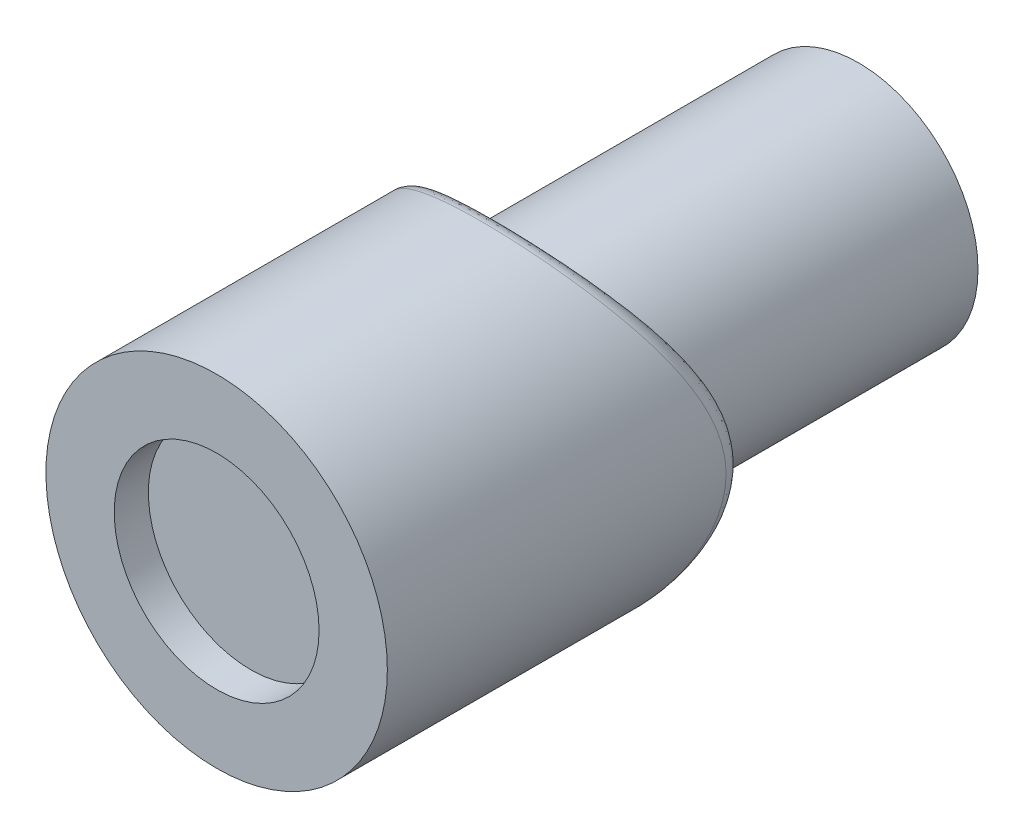
ISO-10303-21;
HEADER;
FILE_DESCRIPTION(('STEP AP214'),'2;1');
FILE_NAME('part.step','',(''),(''),'','','');
FILE_SCHEMA(('AUTOMOTIVE_DESIGN { 1 0 10303 214 1 1 1 1 }'));
ENDSEC;
DATA;
#1=APPLICATION_CONTEXT('core data for automotive mechanical design processes');
#2=APPLICATION_PROTOCOL_DEFINITION('international standard','automotive_design',2000,#1);
#3=PRODUCT_CONTEXT('',#1,'mechanical');
#4=PRODUCT('Part','Part','',(#3));
#5=PRODUCT_RELATED_PRODUCT_CATEGORY('part','',(#4));
#6=PRODUCT_DEFINITION_FORMATION('','',#4);
#7=PRODUCT_DEFINITION_CONTEXT('part definition',#1,'design');
#8=PRODUCT_DEFINITION('design','',#6,#7);
#9=PRODUCT_DEFINITION_SHAPE('','',#8);
#10=(LENGTH_UNIT() NAMED_UNIT(*) SI_UNIT(.MILLI.,.METRE.));
#11=(NAMED_UNIT(*) PLANE_ANGLE_UNIT() SI_UNIT($,.RADIAN.));
#12=(NAMED_UNIT(*) SI_UNIT($,.STERADIAN.) SOLID_ANGLE_UNIT());
#13=UNCERTAINTY_MEASURE_WITH_UNIT(LENGTH_MEASURE(1.E-05),#10,'distance_accuracy_value','');
#14=(GEOMETRIC_REPRESENTATION_CONTEXT(3) GLOBAL_UNCERTAINTY_ASSIGNED_CONTEXT((#13)) GLOBAL_UNIT_ASSIGNED_CONTEXT((#10,
#11,#12)) REPRESENTATION_CONTEXT('',''));
#15=CARTESIAN_POINT('',(0.,0.,0.));
#16=DIRECTION('',(0.,0.,1.));
#17=DIRECTION('',(1.,0.,0.));
#18=AXIS2_PLACEMENT_3D('',#15,#16,#17);
#19=CARTESIAN_POINT('',(0.,0.,-18.7999999999999));
#20=DIRECTION('',(0.,0.,1.));
#21=DIRECTION('',(-1.,0.,0.));
#22=AXIS2_PLACEMENT_3D('',#19,#20,#21);
#23=CYLINDRICAL_SURFACE('',#22,5.);
#24=CARTESIAN_POINT('',(5.,0.,-9.92054473418087));
#25=CARTESIAN_POINT('',(5.,-0.394893347093318,-9.92054473418087));
#26=CARTESIAN_POINT('',(4.90439112526284,-1.18177929090862,-9.80820862824213));
#27=CARTESIAN_POINT('',(4.38934415505402,-2.57361505187322,-9.28963254071878));
#28=CARTESIAN_POINT('',(3.28606552163645,-3.97436445188582,-8.46074115903324));
#29=CARTESIAN_POINT('',(1.58120612322744,-4.85752802696362,-7.85125270224386));
#30=CARTESIAN_POINT('',(-3.95046673941243E-05,-5.04753097211932,-7.71617126727592));
#31=CARTESIAN_POINT('',(-1.58164656688379,-4.85811099232312,-7.85146403600861));
#32=CARTESIAN_POINT('',(-3.28267552439245,-3.97284875756662,-8.45980270555518));
#33=CARTESIAN_POINT('',(-4.46400627954197,-2.48224227307582,-9.34546976278397));
#34=CARTESIAN_POINT('',(-4.91658269566165,-1.11412019175182,-9.82575279474351));
#35=CARTESIAN_POINT('',(-5.02097678568305,-0.0673571387045189,-9.94458309974871));
#36=CARTESIAN_POINT('',(-4.97293000571019,0.727083562253183,-9.88869877113794));
#37=CARTESIAN_POINT('',(-4.77879463510319,1.53280887341578,-9.67932625434388));
#38=CARTESIAN_POINT('',(-4.41014736394243,2.44001492991288,-9.32530515382981));
#39=CARTESIAN_POINT('',(-3.73716068016195,3.42276109136928,-8.79438919773485));
#40=CARTESIAN_POINT('',(-2.61653038221215,4.34400595691088,-8.2063513154436));
#41=CARTESIAN_POINT('',(-0.963182286720671,5.04408430863908,-7.7194685395518));
#42=CARTESIAN_POINT('',(1.23975710410984,5.04132085178308,-7.72233859641075));
#43=CARTESIAN_POINT('',(3.28484165793721,3.97012599557698,-8.46481678207464));
#44=CARTESIAN_POINT('',(4.38938120685682,2.57506555003878,-9.28833432204614));
#45=CARTESIAN_POINT('',(4.90430646282158,1.18132253214788,-9.8086405050776));
#46=CARTESIAN_POINT('',(5.,0.39489334709308,-9.92054473418087));
#47=CARTESIAN_POINT('',(5.,0.,-9.92054473418087));
#48=B_SPLINE_CURVE_WITH_KNOTS('',3,(#24,#25,#26,#27,#28,#29,#30,#31,#32,#33,#34,#35,#36,#37,#38,
#39,#40,#41,#42,#43,#44,#45,#46,#47),.UNSPECIFIED.,.T.,.F.,(4,1,1,1,1,1,1,1,1,1,1,1,1,1,1,1,1,1,
1,1,1,4),(0.,0.12505912159039,0.25011824318078,0.50023648636156,0.75035472954234,
0.87541385113273,1.00047297272312,1.25059121590391,1.50070945908469,1.66745495453854,
1.72998451533374,1.8342004499924,1.91757319771932,2.00094594544625,2.1676914409001,
2.33443693635396,2.50118243180781,2.7513006749886,3.00141891816938,3.25153716135016,
3.37659628294055,3.50165540453094),.UNSPECIFIED.);
#49=CARTESIAN_POINT('',(0.000455912865946351,-5.00010297730149,-7.74996802767991));
#50=VERTEX_POINT('',#49);
#51=EDGE_CURVE('E73',#50,#50,#48,.T.);
#52=ORIENTED_EDGE('',*,*,#51,.F.);
#53=EDGE_LOOP('',(#52));
#54=FACE_BOUND('',#53,.T.);
#55=CARTESIAN_POINT('',(0.,0.,0.));
#56=DIRECTION('',(0.,0.,1.));
#57=DIRECTION('',(1.,0.,0.));
#58=AXIS2_PLACEMENT_3D('',#55,#56,#57);
#59=CIRCLE('',#58,5.);
#60=CARTESIAN_POINT('',(5.,0.,0.));
#61=VERTEX_POINT('',#60);
#62=EDGE_CURVE('E87',#61,#61,#59,.T.);
#63=ORIENTED_EDGE('',*,*,#62,.F.);
#64=EDGE_LOOP('',(#63));
#65=FACE_BOUND('',#64,.T.);
#66=ADVANCED_FACE('F58',(#54,#65),#23,.T.);
#67=CARTESIAN_POINT('',(0.,-24.9999999999999,-13.5));
#68=DIRECTION('',(0.,1.,0.));
#69=DIRECTION('',(1.,0.,0.));
#70=AXIS2_PLACEMENT_3D('',#67,#68,#69);
#71=CYLINDRICAL_SURFACE('',#70,5.25);
#72=CARTESIAN_POINT('',(3.5,0.,-9.58688103937533));
#73=CARTESIAN_POINT('',(3.50000611719063,0.0854647091049416,-9.58689120377895));
#74=CARTESIAN_POINT('',(3.49686684869261,0.170889755800615,-9.5840731315668));
#75=CARTESIAN_POINT('',(3.48439485362699,0.340954986158101,-9.57296919563303));
#76=CARTESIAN_POINT('',(3.47506113941325,0.425595042478148,-9.56468245998563));
#77=CARTESIAN_POINT('',(3.45036953991928,0.593428965199531,-9.54301686819351));
#78=CARTESIAN_POINT('',(3.43500402380312,0.676620859754438,-9.52963156248388));
#79=CARTESIAN_POINT('',(3.39852817445346,0.840889504021654,-9.49836506952547));
#80=CARTESIAN_POINT('',(3.37741490215568,0.921965148301002,-9.4804815825283));
#81=CARTESIAN_POINT('',(3.30640053771775,1.15967554789564,-9.42152288148084));
#82=CARTESIAN_POINT('',(3.24854505862819,1.31262244458563,-9.37487669830528));
#83=CARTESIAN_POINT('',(3.11383765195029,1.606296237759,-9.27227431251976));
#84=CARTESIAN_POINT('',(3.03698177927083,1.74702058823949,-9.21631617723963));
#85=CARTESIAN_POINT('',(2.85255028200114,2.03636747381537,-9.09094717330299));
#86=CARTESIAN_POINT('',(2.74205506184117,2.18280979258011,-9.02079810781556));
#87=CARTESIAN_POINT('',(2.49931137871928,2.45702617584772,-8.88095602686251));
#88=CARTESIAN_POINT('',(2.36704173932502,2.5847818361734,-8.81126352471544));
#89=CARTESIAN_POINT('',(2.14320709501315,2.76908188015296,-8.7065364591506));
#90=CARTESIAN_POINT('',(2.05838214296122,2.83273764054206,-8.66941141366229));
#91=CARTESIAN_POINT('',(1.88244136356879,2.95258085519886,-8.59817315633386));
#92=CARTESIAN_POINT('',(1.79132824354989,3.00877149341182,-8.56405866256289));
#93=CARTESIAN_POINT('',(1.60329942030025,3.11303404357547,-8.49982021170112));
#94=CARTESIAN_POINT('',(1.50638703566589,3.16111053974248,-8.46969400345211));
#95=CARTESIAN_POINT('',(1.30734459173683,3.24848494922879,-8.41433276938135));
#96=CARTESIAN_POINT('',(1.20521565584635,3.28778474293254,-8.38909669601521));
#97=CARTESIAN_POINT('',(1.00828416305443,3.35304123910273,-8.34686118447577));
#98=CARTESIAN_POINT('',(0.913943200466584,3.37999969547979,-8.3292556312934));
#99=CARTESIAN_POINT('',(0.722574252094896,3.42601313357734,-8.29906125409994));
#100=CARTESIAN_POINT('',(0.625546796518179,3.44506966312988,-8.28647144762168));
#101=CARTESIAN_POINT('',(0.429780339674312,3.47492200279245,-8.26669723014357));
#102=CARTESIAN_POINT('',(0.331043118647414,3.48572593221293,-8.25950750639572));
#103=CARTESIAN_POINT('',(0.132765839598167,3.49889154127219,-8.25074124531205));
#104=CARTESIAN_POINT('',(0.0332258968392876,3.50125441207397,-8.2491639159813));
#105=CARTESIAN_POINT('',(-0.150448978281647,3.49778040488676,-8.25147953014932));
#106=CARTESIAN_POINT('',(-0.234618972810558,3.49313867493037,-8.25457518138807));
#107=CARTESIAN_POINT('',(-0.402175577361157,3.47783634357835,-8.26475247801393));
#108=CARTESIAN_POINT('',(-0.485561932026433,3.46717384498323,-8.27183537981815));
#109=CARTESIAN_POINT('',(-0.733573817563579,3.42634755995693,-8.29885479031367));
#110=CARTESIAN_POINT('',(-0.896224820760855,3.38734133944127,-8.32456462903765));
#111=CARTESIAN_POINT('',(-1.21116138452831,3.28790571292165,-8.38908893104452));
#112=CARTESIAN_POINT('',(-1.36348531700839,3.22756145614844,-8.42785127949224));
#113=CARTESIAN_POINT('',(-1.65585928713745,3.08778161967693,-8.51563052744939));
#114=CARTESIAN_POINT('',(-1.79590707794869,3.00834255507119,-8.56464929860059));
#115=CARTESIAN_POINT('',(-2.07949966711279,2.82103705082313,-8.67668402334085));
#116=CARTESIAN_POINT('',(-2.22108567264487,2.71080679139788,-8.740692858594));
#117=CARTESIAN_POINT('',(-2.48497854941621,2.47117735371061,-8.87298945555359));
#118=CARTESIAN_POINT('',(-2.60725507045688,2.34174860683769,-8.94128372217123));
#119=CARTESIAN_POINT('',(-2.84851431013601,2.04406436800719,-9.08737421759251));
#120=CARTESIAN_POINT('',(-2.9640379305271,1.87290060676101,-9.16499940093436));
#121=CARTESIAN_POINT('',(-3.16461026081581,1.509357785096,-9.30917680936689));
#122=CARTESIAN_POINT('',(-3.24971006499231,1.3170150106203,-9.37574749788888));
#123=CARTESIAN_POINT('',(-3.36582268813437,0.971741640768223,-9.47039976980845));
#124=CARTESIAN_POINT('',(-3.40533885777541,0.823211602236818,-9.50404361994846));
#125=CARTESIAN_POINT('',(-3.4646422204605,0.519680892983826,-9.55534180362413));
#126=CARTESIAN_POINT('',(-3.48446362129528,0.364691930498921,-9.573023856257));
#127=CARTESIAN_POINT('',(-3.50313950318952,0.051724773676085,-9.58966775277291));
#128=CARTESIAN_POINT('',(-3.50190277081215,-0.106263462450998,-9.58854815748697));
#129=CARTESIAN_POINT('',(-3.47832851990336,-0.419446709380586,-9.56757709339291));
#130=CARTESIAN_POINT('',(-3.45597389713443,-0.574639352076127,-9.54771044059541));
#131=CARTESIAN_POINT('',(-3.39324669571868,-0.870431480839708,-9.49376039425583));
#132=CARTESIAN_POINT('',(-3.35380805394688,-1.01137349117395,-9.46041922817362));
#133=CARTESIAN_POINT('',(-3.25890322814929,-1.28472091350071,-9.38347572757554));
#134=CARTESIAN_POINT('',(-3.20343166149561,-1.41712344029932,-9.33986994790263));
#135=CARTESIAN_POINT('',(-3.06535856561876,-1.69785350657864,-9.23679903640269));
#136=CARTESIAN_POINT('',(-2.97955050435342,-1.84407442015807,-9.17590607472028));
#137=CARTESIAN_POINT('',(-2.78867280124104,-2.12172940462203,-9.05040599106322));
#138=CARTESIAN_POINT('',(-2.68357970795704,-2.25314515431144,-8.98579441347031));
#139=CARTESIAN_POINT('',(-2.43034150997976,-2.52693410805347,-8.84367562931853));
#140=CARTESIAN_POINT('',(-2.27780676400178,-2.66542998443107,-8.7664345875581));
#141=CARTESIAN_POINT('',(-1.94792410515571,-2.91517919514907,-8.62142731778811));
#142=CARTESIAN_POINT('',(-1.77059833554932,-3.02645659969864,-8.55365274118798));
#143=CARTESIAN_POINT('',(-1.43060308093852,-3.19881054310637,-8.44616062825822));
#144=CARTESIAN_POINT('',(-1.27165913855033,-3.26542388277495,-8.40355448305797));
#145=CARTESIAN_POINT('',(-0.942824888286656,-3.37506259005656,-8.33262261232608));
#146=CARTESIAN_POINT('',(-0.772943961756185,-3.41810787998816,-8.30428482723459));
#147=CARTESIAN_POINT('',(-0.425896436527699,-3.47846968673442,-8.26437862953742));
#148=CARTESIAN_POINT('',(-0.248700964604929,-3.49567168919878,-8.25288486003209));
#149=CARTESIAN_POINT('',(0.10649720650363,-3.50288373991794,-8.24807813197003));
#150=CARTESIAN_POINT('',(0.284499829121307,-3.49289631569174,-8.2547634834889));
#151=CARTESIAN_POINT('',(0.622575681967957,-3.44809589445661,-8.28448277047124));
#152=CARTESIAN_POINT('',(0.783011500531311,-3.41514077726643,-8.30629264909599));
#153=CARTESIAN_POINT('',(1.09553224008693,-3.32808348272132,-8.36311814111009));
#154=CARTESIAN_POINT('',(1.24761585961412,-3.27397802025831,-8.39813580592586));
#155=CARTESIAN_POINT('',(1.54900776968655,-3.14310726950392,-8.48114410504922));
#156=CARTESIAN_POINT('',(1.69764628348348,-3.06521197357348,-8.52976814749153));
#157=CARTESIAN_POINT('',(1.9802171573111,-2.89073636020775,-8.63543035182428));
#158=CARTESIAN_POINT('',(2.11414064216952,-2.79414486233727,-8.69247354354221));
#159=CARTESIAN_POINT('',(2.38576489884515,-2.56789947153875,-8.82062371678394));
#160=CARTESIAN_POINT('',(2.52074693304202,-2.43543491133915,-8.89253157743953));
#161=CARTESIAN_POINT('',(2.76780034856169,-2.15055109937514,-9.03656617078804));
#162=CARTESIAN_POINT('',(2.87985459047814,-1.99811705826204,-9.10869302661088));
#163=CARTESIAN_POINT('',(3.07148207991606,-1.68723241934365,-9.24077650593515));
#164=CARTESIAN_POINT('',(3.15288183690024,-1.53012936477267,-9.30124185984614));
#165=CARTESIAN_POINT('',(3.29202602576533,-1.20174968702904,-9.40941784604453));
#166=CARTESIAN_POINT('',(3.34981641396462,-1.03050138711281,-9.45715319412194));
#167=CARTESIAN_POINT('',(3.42888608450925,-0.716157245590796,-9.52415912723014));
#168=CARTESIAN_POINT('',(3.45541898838889,-0.57523507289307,-9.54739381929413));
#169=CARTESIAN_POINT('',(3.4909635390983,-0.289501832071819,-9.57873993176136));
#170=CARTESIAN_POINT('',(3.49998964343016,-0.144694073042197,-9.58686383076401));
#171=CARTESIAN_POINT('',(3.5,0.,-9.58688103937533));
#172=B_SPLINE_CURVE_WITH_KNOTS('',3,(#72,#73,#74,#75,#76,#77,#78,#79,#80,#81,#82,#83,#84,#85,
#86,#87,#88,#89,#90,#91,#92,#93,#94,#95,#96,#97,#98,#99,#100,#101,#102,#103,#104,#105,#106,#107,
#108,#109,#110,#111,#112,#113,#114,#115,#116,#117,#118,#119,#120,#121,#122,#123,#124,#125,#126,
#127,#128,#129,#130,#131,#132,#133,#134,#135,#136,#137,#138,#139,#140,#141,#142,#143,#144,#145,
#146,#147,#148,#149,#150,#151,#152,#153,#154,#155,#156,#157,#158,#159,#160,#161,#162,#163,#164,
#165,#166,#167,#168,#169,#170,#171),.UNSPECIFIED.,.T.,.F.,(4,2,2,2,2,2,2,2,2,2,2,2,2,2,2,2,2,2,
2,2,2,2,2,2,2,2,2,2,2,2,2,2,2,2,2,2,2,2,2,2,2,2,2,2,2,2,2,2,2,4),(0.,0.256223421071084,
0.512487704375487,0.769077238026187,1.02579822371203,1.53370703938676,2.04172140192289,
2.62881174846292,3.21647647238515,3.55317305855633,3.88972557623953,4.2260873119646,
4.56237691382749,4.86097952626889,5.15952362066916,5.45777361316046,5.75598151633432,
6.00872715356612,6.2615524777489,6.76669178598897,7.26983767555425,7.77307546182591,
8.34244232008952,8.91269537496458,9.57148792735993,10.2291688365425,10.6993171980466,
11.1686475251444,11.6400112746891,12.1117571285089,12.5604485209604,13.0092907249278,
13.5478471420572,14.0870628601675,14.7440675952579,15.4004892011613,15.9308457768458,
16.4607533416894,16.993002128299,17.5252014389486,18.0187043055113,18.5122838542658,
19.0344232183943,19.5568757949351,20.1614992261201,20.7665729984667,21.3254578175837,
21.8832495075026,22.3174014014656,22.7511946102862),.UNSPECIFIED.);
#173=CARTESIAN_POINT('',(3.5,0.,-9.58688103937533));
#174=VERTEX_POINT('',#173);
#175=EDGE_CURVE('E12',#174,#174,#172,.T.);
#176=ORIENTED_EDGE('',*,*,#175,.T.);
#177=EDGE_LOOP('',(#176));
#178=FACE_BOUND('',#177,.T.);
#179=CARTESIAN_POINT('',(4.1086956521739,0.,-10.2318017138173));
#180=CARTESIAN_POINT('',(4.1086956521739,0.355404012383881,-10.2318017138173));
#181=CARTESIAN_POINT('',(4.03006052814469,1.06319027893308,-10.1296282872448));
#182=CARTESIAN_POINT('',(3.60692629606929,2.31755899503488,-9.65456612012908));
#183=CARTESIAN_POINT('',(2.69928292760927,3.57311339601928,-8.90265880102467));
#184=CARTESIAN_POINT('',(1.01875692468156,4.53718876660478,-8.22474393585329));
#185=CARTESIAN_POINT('',(-0.791484574740033,4.53967587777518,-8.22212344915599));
#186=CARTESIAN_POINT('',(-2.15010540103521,3.90960536121978,-8.66666859236155));
#187=CARTESIAN_POINT('',(-3.07097116761135,3.08048498223238,-9.2035727457579));
#188=CARTESIAN_POINT('',(-3.62399065993531,2.19601343692158,-9.68832209697505));
#189=CARTESIAN_POINT('',(-3.92692254797611,1.37952798607418,-10.0115587539662));
#190=CARTESIAN_POINT('',(-4.08645117860534,0.654375206027879,-10.202724964952));
#191=CARTESIAN_POINT('',(-4.12593309780042,-0.0606214248341196,-10.2537497867271));
#192=CARTESIAN_POINT('',(-4.04014838904371,-1.00270817257662,-10.1452525517223));
#193=CARTESIAN_POINT('',(-3.66824863840623,-2.23401804576822,-9.70673326167232));
#194=CARTESIAN_POINT('',(-2.6975029309138,-3.57556388180992,-8.89808073115908));
#195=CARTESIAN_POINT('',(-1.29970087452625,-4.37229989309082,-8.34264107635569));
#196=CARTESIAN_POINT('',(-3.24625310350019E-05,-4.54277787490742,-8.21911289620845));
#197=CARTESIAN_POINT('',(1.29933894473907,-4.37177522426722,-8.34244811944004));
#198=CARTESIAN_POINT('',(2.70028862430125,-3.57692800669722,-8.89893757998687));
#199=CARTESIAN_POINT('',(3.60689584915308,-2.31625354668592,-9.65575145022149));
#200=CARTESIAN_POINT('',(4.03013009858555,-1.06360136181772,-10.1292339649167));
#201=CARTESIAN_POINT('',(4.1086956521739,-0.35540401238392,-10.2318017138173));
#202=CARTESIAN_POINT('',(4.1086956521739,0.,-10.2318017138173));
#203=B_SPLINE_CURVE_WITH_KNOTS('',3,(#179,#180,#181,#182,#183,#184,#185,#186,#187,#188,#189,
#190,#191,#192,#193,#194,#195,#196,#197,#198,#199,#200,#201,#202),.UNSPECIFIED.,.T.,.F.,(4,1,1,
1,1,1,1,1,1,1,1,1,1,1,1,1,1,1,1,1,1,4),(0.,0.125059121590391,0.250118243180782,
0.500236486361563,0.750354729542345,1.00047297272313,1.16721846817698,1.33396396363084,
1.50070945908469,1.58408220681162,1.66745495453854,1.7716708891972,1.8342004499924,
2.00094594544625,2.25106418862703,2.50118243180782,2.62624155339821,2.7513006749886,
3.00141891816938,3.25153716135016,3.37659628294055,3.50165540453094),.UNSPECIFIED.);
#204=CARTESIAN_POINT('',(4.1086956521739,0.,-10.2318017138173));
#205=VERTEX_POINT('',#204);
#206=EDGE_CURVE('E78',#205,#205,#203,.T.);
#207=ORIENTED_EDGE('',*,*,#206,.F.);
#208=EDGE_LOOP('',(#207));
#209=FACE_BOUND('',#208,.T.);
#210=ADVANCED_FACE('F154',(#178,#209),#71,.F.);
#211=CARTESIAN_POINT('',(4.1086956521739,0.,-10.2318017138173));
#212=CARTESIAN_POINT('',(4.1086956521739,0.355404012383881,-10.2318017138173));
#213=CARTESIAN_POINT('',(4.03006052814469,1.06319027893308,-10.1296282872448));
#214=CARTESIAN_POINT('',(3.60692629606929,2.31755899503488,-9.65456612012908));
#215=CARTESIAN_POINT('',(2.69928292760927,3.57311339601928,-8.90265880102467));
#216=CARTESIAN_POINT('',(1.01875692468156,4.53718876660478,-8.22474393585329));
#217=CARTESIAN_POINT('',(-0.791484574740033,4.53967587777518,-8.22212344915599));
#218=CARTESIAN_POINT('',(-2.15010540103521,3.90960536121978,-8.66666859236155));
#219=CARTESIAN_POINT('',(-3.07097116761135,3.08048498223238,-9.2035727457579));
#220=CARTESIAN_POINT('',(-3.62399065993531,2.19601343692158,-9.68832209697505));
#221=CARTESIAN_POINT('',(-3.92692254797611,1.37952798607418,-10.0115587539662));
#222=CARTESIAN_POINT('',(-4.08645117860534,0.654375206027879,-10.202724964952));
#223=CARTESIAN_POINT('',(-4.12593309780042,-0.0606214248341196,-10.2537497867271));
#224=CARTESIAN_POINT('',(-4.04014838904371,-1.00270817257662,-10.1452525517223));
#225=CARTESIAN_POINT('',(-3.66824863840623,-2.23401804576822,-9.70673326167232));
#226=CARTESIAN_POINT('',(-2.6975029309138,-3.57556388180992,-8.89808073115908));
#227=CARTESIAN_POINT('',(-1.29970087452625,-4.37229989309082,-8.34264107635569));
#228=CARTESIAN_POINT('',(-3.24625310350019E-05,-4.54277787490742,-8.21911289620845));
#229=CARTESIAN_POINT('',(1.29933894473907,-4.37177522426722,-8.34244811944004));
#230=CARTESIAN_POINT('',(2.70028862430125,-3.57692800669722,-8.89893757998687));
#231=CARTESIAN_POINT('',(3.60689584915308,-2.31625354668592,-9.65575145022149));
#232=CARTESIAN_POINT('',(4.03013009858555,-1.06360136181772,-10.1292339649167));
#233=CARTESIAN_POINT('',(4.1086956521739,-0.35540401238392,-10.2318017138173));
#234=CARTESIAN_POINT('',(4.1086956521739,0.,-10.2318017138173));
#235=CARTESIAN_POINT('',(4.18190453161171,0.,-10.323838052591));
#236=CARTESIAN_POINT('',(4.18190453161171,0.370307742190181,-10.323838052591));
#237=CARTESIAN_POINT('',(4.1001123963221,1.10660251306938,-10.2127336478515));
#238=CARTESIAN_POINT('',(3.66752537909717,2.38647437766228,-9.70904365418564));
#239=CARTESIAN_POINT('',(2.74674767552571,3.64741967787928,-8.92651978728953));
#240=CARTESIAN_POINT('',(1.03764420692711,4.61208961893098,-8.22380377546048));
#241=CARTESIAN_POINT('',(-0.806161017432783,4.61447706712768,-8.22107425117599));
#242=CARTESIAN_POINT('',(-2.18838912529898,3.98421974426578,-8.68191372550684));
#243=CARTESIAN_POINT('',(-3.12366649828941,3.15295840479358,-9.23942365624188));
#244=CARTESIAN_POINT('',(-3.68533291559085,2.26161227265628,-9.74566408753557));
#245=CARTESIAN_POINT('',(-3.99453308302555,1.42954606771278,-10.0873029617173));
#246=CARTESIAN_POINT('',(-4.15861024312191,0.682319000750982,-10.2920767819136));
#247=CARTESIAN_POINT('',(-4.19974581456743,-0.0634598796571181,-10.3477182800912));
#248=CARTESIAN_POINT('',(-4.11071269892346,-1.04384033803182,-10.229937962917));
#249=CARTESIAN_POINT('',(-3.72962022986456,-2.30306941056552,-9.76319399713232));
#250=CARTESIAN_POINT('',(-2.74504184564213,-3.64941785562192,-8.92189851675787));
#251=CARTESIAN_POINT('',(-1.32334591372717,-4.44731138230892,-8.34595521075918));
#252=CARTESIAN_POINT('',(-3.80488293747386E-05,-4.61753469116832,-8.21798366985019));
#253=CARTESIAN_POINT('',(1.3230157322862,-4.44667725307452,-8.34578774991725));
#254=CARTESIAN_POINT('',(2.74775744853231,-3.65118433020092,-8.92269315395222));
#255=CARTESIAN_POINT('',(3.66749838641275,-2.38518449907502,-9.71026574574402));
#256=CARTESIAN_POINT('',(4.10018192348197,-1.10700824755762,-10.2123279196446));
#257=CARTESIAN_POINT('',(4.18190453161171,-0.37030774219032,-10.323838052591));
#258=CARTESIAN_POINT('',(4.18190453161171,0.,-10.323838052591));
#259=CARTESIAN_POINT('',(4.39583356980792,0.,-10.4538383808515));
#260=CARTESIAN_POINT('',(4.39583356980792,0.400115982464481,-10.4538383808515));
#261=CARTESIAN_POINT('',(4.30351771245354,1.19337692673388,-10.3254541866776));
#262=CARTESIAN_POINT('',(3.83424471769339,2.52425759555068,-9.7676242407536));
#263=CARTESIAN_POINT('',(2.86447237731918,3.79598123016518,-8.93075569024995));
#264=CARTESIAN_POINT('',(1.08096396069831,4.76186413929568,-8.1881887438848));
#265=CARTESIAN_POINT('',(-0.839797062244316,4.76404408294188,-8.18530617010587));
#266=CARTESIAN_POINT('',(-2.28171602458183,4.13340432297688,-8.67234660935035));
#267=CARTESIAN_POINT('',(-3.26099444423202,3.29785111933538,-9.26475027787611));
#268=CARTESIAN_POINT('',(-3.8552280857925,2.39275889503988,-9.80980598101622));
#269=CARTESIAN_POINT('',(-4.1886258257808,1.52954084888388,-10.1860522721151));
#270=CARTESIAN_POINT('',(-4.36945964790362,0.738172553442681,-10.4168139798515));
#271=CARTESIAN_POINT('',(-4.41603656333767,-0.0691243728650186,-10.4813886231112));
#272=CARTESIAN_POINT('',(-4.31592933087585,-1.12608433373412,-10.3457277643622));
#273=CARTESIAN_POINT('',(-3.89955885783782,-2.44110830014592,-9.82520680879069));
#274=CARTESIAN_POINT('',(-2.86274708226779,-3.79708041053632,-8.92618884060995));
#275=CARTESIAN_POINT('',(-1.37907402022176,-4.59730204931282,-8.31710952763946));
#276=CARTESIAN_POINT('',(-4.56447599772924E-05,-4.76701803987972,-8.18211608142054));
#277=CARTESIAN_POINT('',(1.37876801846139,-4.59645079979292,-8.31698820157079));
#278=CARTESIAN_POINT('',(2.86553607159003,-3.79965128387582,-8.92678194466347));
#279=CARTESIAN_POINT('',(3.8342179841402,-2.52299801343212,-9.76889668416005));
#280=CARTESIAN_POINT('',(4.30359100248816,-1.19377246779532,-10.3250324254249));
#281=CARTESIAN_POINT('',(4.39583356980792,-0.40011598246462,-10.4538383808515));
#282=CARTESIAN_POINT('',(4.39583356980792,0.,-10.4538383808515));
#283=CARTESIAN_POINT('',(4.73537113685872,0.,-10.3989510730428));
#284=CARTESIAN_POINT('',(4.73537113685872,0.421520262231082,-10.3989510730428));
#285=CARTESIAN_POINT('',(4.6295363067945,1.25643635064478,-10.2635144920819));
#286=CARTESIAN_POINT('',(4.1041218533711,2.63983418476348,-9.68146068150942));
#287=CARTESIAN_POINT('',(3.04801691720017,3.94352301027088,-8.8178813184461));
#288=CARTESIAN_POINT('',(1.14583373397293,4.92750925725608,-8.05587062685183));
#289=CARTESIAN_POINT('',(-0.890203657526836,4.92964287105628,-8.05291110330871));
#290=CARTESIAN_POINT('',(-2.42615735485299,4.28733474701248,-8.55269083365148));
#291=CARTESIAN_POINT('',(-3.47916516771939,3.43323759765888,-9.16235151200078));
#292=CARTESIAN_POINT('',(-4.12920868371559,2.50232894329778,-9.72605042055763));
#293=CARTESIAN_POINT('',(-4.50058892995577,1.60603607630398,-10.1179307469192));
#294=CARTESIAN_POINT('',(-4.70503712347009,0.777961675397081,-10.3598841349009));
#295=CARTESIAN_POINT('',(-4.75846446847361,-0.0730026130873196,-10.4280845771177));
#296=CARTESIAN_POINT('',(-4.64410404649649,-1.18569307784892,-10.2850422242055));
#297=CARTESIAN_POINT('',(-4.17517731248959,-2.55496756502492,-9.74083329930385));
#298=CARTESIAN_POINT('',(-3.04621596290992,-3.94426741181902,-8.81324267199808));
#299=CARTESIAN_POINT('',(-1.46377684974438,-4.76006121649692,-8.18811295186986));
#300=CARTESIAN_POINT('',(-4.63420263732855E-05,-4.93261121113742,-8.04968332605297));
#301=CARTESIAN_POINT('',(1.4634482130161,-4.75911370235312,-8.18799838267878));
#302=CARTESIAN_POINT('',(3.04911653798647,-3.94719009439562,-8.81386330692688));
#303=CARTESIAN_POINT('',(4.10410232347751,-2.63857168669792,-9.68275306374459));
#304=CARTESIAN_POINT('',(4.62961069227524,-1.25683189710682,-10.2630874878417));
#305=CARTESIAN_POINT('',(4.73537113685872,-0.42152026223132,-10.3989510730428));
#306=CARTESIAN_POINT('',(4.73537113685872,0.,-10.3989510730428));
#307=CARTESIAN_POINT('',(4.95205027645823,0.,-10.1848047539988));
#308=CARTESIAN_POINT('',(4.95205027645823,0.417330398035981,-10.1848047539988));
#309=CARTESIAN_POINT('',(4.84505849139633,1.24560980426318,-10.0580572524501));
#310=CARTESIAN_POINT('',(4.30197755346154,2.65028864786488,-9.49801114175837));
#311=CARTESIAN_POINT('',(3.19504989573111,3.99956149609048,-8.64687713426816));
#312=CARTESIAN_POINT('',(1.20049193852263,5.02049580534568,-7.89004217577087));
#313=CARTESIAN_POINT('',(-0.93267220251776,5.02287039221858,-7.88710961940275));
#314=CARTESIAN_POINT('',(-2.54286860248812,4.35613315553548,-8.38348367052767));
#315=CARTESIAN_POINT('',(-3.6472229402299,3.47112976486078,-8.98676180014796));
#316=CARTESIAN_POINT('',(-4.32706320385925,2.51170959761378,-9.53974253041671));
#317=CARTESIAN_POINT('',(-4.71200818636088,1.60035541303508,-9.91828927525054));
#318=CARTESIAN_POINT('',(-4.92153202510367,0.769633467113879,-10.1483526348513));
#319=CARTESIAN_POINT('',(-4.97543518690414,-0.0719089474401184,-10.2119879923552));
#320=CARTESIAN_POINT('',(-4.85956464730727,-1.17514606338802,-10.0779185270535));
#321=CARTESIAN_POINT('',(-4.37657975316376,-2.56176456618742,-9.55669081034798));
#322=CARTESIAN_POINT('',(-3.19304904269681,-4.00097682984412,-8.64211148726224));
#323=CARTESIAN_POINT('',(-1.53390357937028,-4.84647501799232,-8.02148616936902));
#324=CARTESIAN_POINT('',(-4.19103324935655E-05,-5.02598630533172,-7.88384241214891));
#325=CARTESIAN_POINT('',(1.53351044019952,-4.84565275400442,-8.02133319340046));
#326=CARTESIAN_POINT('',(3.19620964186249,-4.00340554236852,-8.64281350721616));
#327=CARTESIAN_POINT('',(4.30195327799811,-2.64896303737412,-9.49931109342304));
#328=CARTESIAN_POINT('',(4.84513717987257,-1.24602479587682,-10.0576260244255));
#329=CARTESIAN_POINT('',(4.95205027645823,-0.417330398036219,-10.1848047539988));
#330=CARTESIAN_POINT('',(4.95205027645823,0.,-10.1848047539988));
#331=CARTESIAN_POINT('',(5.,0.,-10.0087462255057));
#332=CARTESIAN_POINT('',(5.,0.403702265917481,-10.0087462255057));
#333=CARTESIAN_POINT('',(4.89953432187779,1.20660983999358,-9.89189066447932));
#334=CARTESIAN_POINT('',(4.37107759600308,2.60705270218338,-9.35819854708252));
#335=CARTESIAN_POINT('',(3.26035422061798,3.98744756423698,-8.52550144387078));
#336=CARTESIAN_POINT('',(1.22798672273521,5.04070837675438,-7.77822874063607));
#337=CARTESIAN_POINT('',(-0.954037076650788,5.04331850478878,-7.77533770612189));
#338=CARTESIAN_POINT('',(-2.59599641603275,4.35514956346708,-8.26536390979509));
#339=CARTESIAN_POINT('',(-3.71477217293095,3.44622383843298,-8.8585408361581));
#340=CARTESIAN_POINT('',(-4.39365169479117,2.47040608491828,-9.39682451342568));
#341=CARTESIAN_POINT('',(-4.7704708294218,1.55998635187828,-9.7590702207776));
#342=CARTESIAN_POINT('',(-4.97151424644433,0.743692897521181,-9.9754345281233));
#343=CARTESIAN_POINT('',(-5.02202125972848,-0.0690983460862188,-10.0339112515086));
#344=CARTESIAN_POINT('',(-4.91273125899493,-1.13813265410532,-9.90994523750306));
#345=CARTESIAN_POINT('',(-4.44606923898773,-2.51563322248682,-9.41589169317855));
#346=CARTESIAN_POINT('',(-3.25822904040031,-3.98970092592272,-8.52053252026562));
#347=CARTESIAN_POINT('',(-1.56774000868902,-4.86079079309862,-7.90813297355888));
#348=CARTESIAN_POINT('',(-3.9448340894798E-05,-5.04664149749442,-7.77205522416826));
#349=CARTESIAN_POINT('',(1.56731059200266,-4.86012651180132,-7.90793998621157));
#350=CARTESIAN_POINT('',(3.26155784103261,-3.99153728628132,-8.52144447118496));
#351=CARTESIAN_POINT('',(4.37104507598436,-2.60564948498312,-9.3594951559765));
#352=CARTESIAN_POINT('',(4.89961697711148,-1.20705088530952,-9.89146038156022));
#353=CARTESIAN_POINT('',(5.,-0.403702265917719,-10.0087462255057));
#354=CARTESIAN_POINT('',(5.,0.,-10.0087462255057));
#355=CARTESIAN_POINT('',(5.,0.,-9.92054473418087));
#356=CARTESIAN_POINT('',(5.,0.39489334709308,-9.92054473418087));
#357=CARTESIAN_POINT('',(4.90430646282158,1.18132253214788,-9.8086405050776));
#358=CARTESIAN_POINT('',(4.38938120685682,2.57506555003878,-9.28833432204614));
#359=CARTESIAN_POINT('',(3.28484165793721,3.97012599557698,-8.46481678207464));
#360=CARTESIAN_POINT('',(1.23975710410984,5.04132085178308,-7.72233859641075));
#361=CARTESIAN_POINT('',(-0.963182286720671,5.04408430863908,-7.7194685395518));
#362=CARTESIAN_POINT('',(-2.61653038221215,4.34400595691088,-8.2063513154436));
#363=CARTESIAN_POINT('',(-3.73716068016195,3.42276109136928,-8.79438919773485));
#364=CARTESIAN_POINT('',(-4.41014736394243,2.44001492991288,-9.32530515382981));
#365=CARTESIAN_POINT('',(-4.77879463510319,1.53280887341578,-9.67932625434388));
#366=CARTESIAN_POINT('',(-4.97293000571019,0.727083562253183,-9.88869877113794));
#367=CARTESIAN_POINT('',(-5.02097678568305,-0.0673571387045189,-9.94458309974871));
#368=CARTESIAN_POINT('',(-4.91658269566165,-1.11412019175182,-9.82575279474351));
#369=CARTESIAN_POINT('',(-4.46400627954197,-2.48224227307582,-9.34546976278397));
#370=CARTESIAN_POINT('',(-3.28267552439245,-3.97284875756662,-8.45980270555518));
#371=CARTESIAN_POINT('',(-1.58164656688379,-4.85811099232312,-7.85146403600861));
#372=CARTESIAN_POINT('',(-3.95046673941243E-05,-5.04753097211932,-7.71617126727592));
#373=CARTESIAN_POINT('',(1.58120612322744,-4.85752802696362,-7.85125270224386));
#374=CARTESIAN_POINT('',(3.28606552163645,-3.97436445188582,-8.46074115903324));
#375=CARTESIAN_POINT('',(4.38934415505402,-2.57361505187322,-9.28963254071878));
#376=CARTESIAN_POINT('',(4.90439112526284,-1.18177929090862,-9.80820862824213));
#377=CARTESIAN_POINT('',(5.,-0.394893347093318,-9.92054473418087));
#378=CARTESIAN_POINT('',(5.,0.,-9.92054473418087));
#379=B_SPLINE_SURFACE_WITH_KNOTS('',3,3,((#211,#212,#213,#214,#215,#216,#217,#218,#219,#220,
#221,#222,#223,#224,#225,#226,#227,#228,#229,#230,#231,#232,#233,#234),(#235,#236,#237,#238,
#239,#240,#241,#242,#243,#244,#245,#246,#247,#248,#249,#250,#251,#252,#253,#254,#255,#256,#257,
#258),(#259,#260,#261,#262,#263,#264,#265,#266,#267,#268,#269,#270,#271,#272,#273,#274,#275,
#276,#277,#278,#279,#280,#281,#282),(#283,#284,#285,#286,#287,#288,#289,#290,#291,#292,#293,
#294,#295,#296,#297,#298,#299,#300,#301,#302,#303,#304,#305,#306),(#307,#308,#309,#310,#311,
#312,#313,#314,#315,#316,#317,#318,#319,#320,#321,#322,#323,#324,#325,#326,#327,#328,#329,#330),
(#331,#332,#333,#334,#335,#336,#337,#338,#339,#340,#341,#342,#343,#344,#345,#346,#347,#348,#349,
#350,#351,#352,#353,#354),(#355,#356,#357,#358,#359,#360,#361,#362,#363,#364,#365,#366,#367,
#368,#369,#370,#371,#372,#373,#374,#375,#376,#377,#378)),.UNSPECIFIED.,.F.,.T.,.F.,(4,1,1,1,4),
(4,1,1,1,1,1,1,1,1,1,1,1,1,1,1,1,1,1,1,1,1,4),(0.,0.285714285714286,0.571428571428571,
0.785714285714286,1.),(0.,0.125059121590391,0.250118243180782,0.500236486361563,
0.750354729542345,1.00047297272313,1.16721846817698,1.33396396363084,1.50070945908469,
1.58408220681162,1.66745495453854,1.7716708891972,1.8342004499924,2.00094594544625,
2.25106418862703,2.50118243180782,2.62624155339821,2.7513006749886,3.00141891816938,
3.25153716135016,3.37659628294055,3.50165540453094),.UNSPECIFIED.);
#380=ORIENTED_EDGE('',*,*,#206,.T.);
#381=EDGE_LOOP('',(#380));
#382=FACE_BOUND('',#381,.T.);
#383=ORIENTED_EDGE('',*,*,#51,.T.);
#384=EDGE_LOOP('',(#383));
#385=FACE_BOUND('',#384,.T.);
#386=ADVANCED_FACE('F60',(#382,#385),#379,.F.);
#387=CARTESIAN_POINT('',(0.,0.,0.));
#388=DIRECTION('',(0.,0.,1.));
#389=DIRECTION('',(1.,0.,0.));
#390=AXIS2_PLACEMENT_3D('',#387,#388,#389);
#391=PLANE('',#390);
#392=CARTESIAN_POINT('',(0.,0.,0.));
#393=DIRECTION('',(0.,0.,1.));
#394=DIRECTION('',(1.,0.,0.));
#395=AXIS2_PLACEMENT_3D('',#392,#393,#394);
#396=CIRCLE('',#395,3.);
#397=CARTESIAN_POINT('',(3.,0.,0.));
#398=VERTEX_POINT('',#397);
#399=EDGE_CURVE('E298',#398,#398,#396,.T.);
#400=ORIENTED_EDGE('',*,*,#399,.F.);
#401=EDGE_LOOP('',(#400));
#402=FACE_BOUND('',#401,.T.);
#403=ORIENTED_EDGE('',*,*,#62,.T.);
#404=EDGE_LOOP('',(#403));
#405=FACE_BOUND('',#404,.T.);
#406=ADVANCED_FACE('F158',(#402,#405),#391,.T.);
#407=CARTESIAN_POINT('',(0.,0.,-18.7999999999999));
#408=DIRECTION('',(0.,0.,1.));
#409=DIRECTION('',(1.,0.,0.));
#410=AXIS2_PLACEMENT_3D('',#407,#408,#409);
#411=CYLINDRICAL_SURFACE('',#410,3.5);
#412=CARTESIAN_POINT('',(0.,0.,-18.7999999999999));
#413=DIRECTION('',(0.,0.,1.));
#414=DIRECTION('',(1.,0.,0.));
#415=AXIS2_PLACEMENT_3D('',#412,#413,#414);
#416=CIRCLE('',#415,3.5);
#417=CARTESIAN_POINT('',(3.49999999999996,0.,-18.8));
#418=VERTEX_POINT('',#417);
#419=EDGE_CURVE('E95',#418,#418,#416,.T.);
#420=ORIENTED_EDGE('',*,*,#419,.T.);
#421=EDGE_LOOP('',(#420));
#422=FACE_BOUND('',#421,.T.);
#423=ORIENTED_EDGE('',*,*,#175,.F.);
#424=EDGE_LOOP('',(#423));
#425=FACE_BOUND('',#424,.T.);
#426=ADVANCED_FACE('F208',(#422,#425),#411,.T.);
#427=CARTESIAN_POINT('',(0.000284266976305101,-3.49999998845606,-18.7999999999999));
#428=DIRECTION('',(0.,0.,-1.));
#429=DIRECTION('',(-1.,0.,0.));
#430=AXIS2_PLACEMENT_3D('',#427,#428,#429);
#431=PLANE('',#430);
#432=ORIENTED_EDGE('',*,*,#419,.F.);
#433=EDGE_LOOP('',(#432));
#434=FACE_BOUND('',#433,.T.);
#435=ADVANCED_FACE('F216',(#434),#431,.T.);
#436=CARTESIAN_POINT('',(0.,0.,-1.));
#437=DIRECTION('',(0.,0.,1.));
#438=DIRECTION('',(1.,0.,0.));
#439=AXIS2_PLACEMENT_3D('',#436,#437,#438);
#440=CYLINDRICAL_SURFACE('',#439,3.);
#441=CARTESIAN_POINT('',(0.,0.,-1.));
#442=DIRECTION('',(0.,0.,1.));
#443=DIRECTION('',(1.,0.,0.));
#444=AXIS2_PLACEMENT_3D('',#441,#442,#443);
#445=CIRCLE('',#444,3.);
#446=CARTESIAN_POINT('',(3.,0.,-1.));
#447=VERTEX_POINT('',#446);
#448=EDGE_CURVE('E100',#447,#447,#445,.T.);
#449=ORIENTED_EDGE('',*,*,#448,.F.);
#450=EDGE_LOOP('',(#449));
#451=FACE_BOUND('',#450,.T.);
#452=ORIENTED_EDGE('',*,*,#399,.T.);
#453=EDGE_LOOP('',(#452));
#454=FACE_BOUND('',#453,.T.);
#455=ADVANCED_FACE('F224',(#451,#454),#440,.F.);
#456=CARTESIAN_POINT('',(0.,0.,-1.));
#457=DIRECTION('',(0.,0.,1.));
#458=DIRECTION('',(1.,0.,0.));
#459=AXIS2_PLACEMENT_3D('',#456,#457,#458);
#460=PLANE('',#459);
#461=ORIENTED_EDGE('',*,*,#448,.T.);
#462=EDGE_LOOP('',(#461));
#463=FACE_BOUND('',#462,.T.);
#464=ADVANCED_FACE('F233',(#463),#460,.T.);
#465=CLOSED_SHELL('',(#66,#210,#386,#406,#426,#435,#455,#464));
#466=MANIFOLD_SOLID_BREP('B2',#465);
#467=ADVANCED_BREP_SHAPE_REPRESENTATION('',(#18,#466),#14);
#468=SHAPE_DEFINITION_REPRESENTATION(#9,#467);
ENDSEC;
END-ISO-10303-21;
